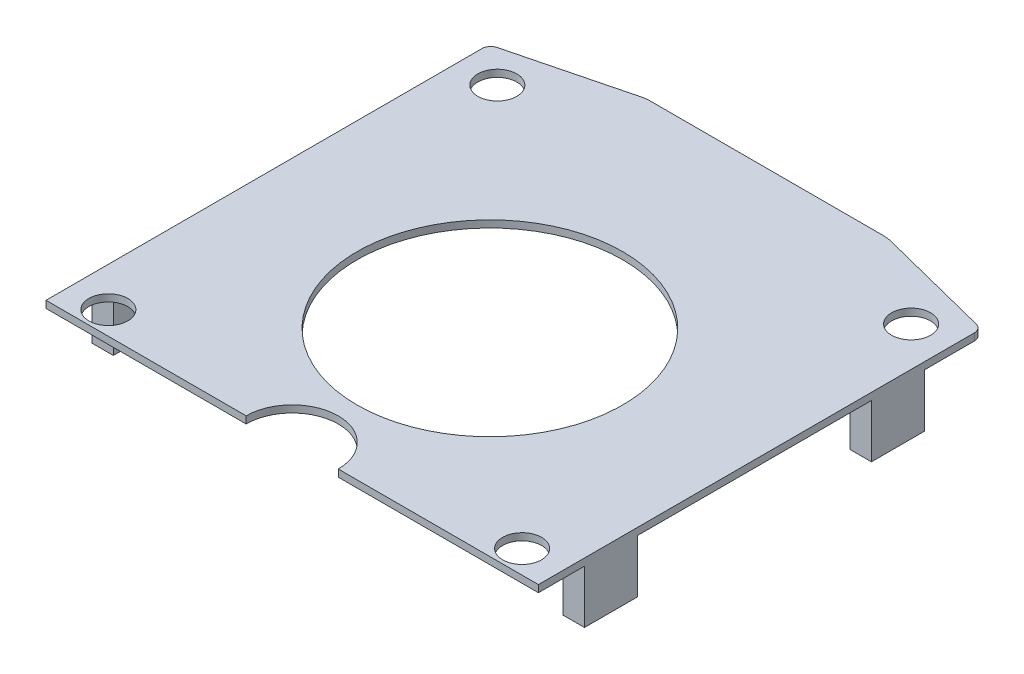
ISO-10303-21;
HEADER;
FILE_DESCRIPTION(('STEP AP214'),'2;1');
FILE_NAME('part.step','',(''),(''),'','','');
FILE_SCHEMA(('AUTOMOTIVE_DESIGN { 1 0 10303 214 1 1 1 1 }'));
ENDSEC;
DATA;
#1=APPLICATION_CONTEXT('core data for automotive mechanical design processes');
#2=APPLICATION_PROTOCOL_DEFINITION('international standard','automotive_design',2000,#1);
#3=PRODUCT_CONTEXT('',#1,'mechanical');
#4=PRODUCT('Part','Part','',(#3));
#5=PRODUCT_RELATED_PRODUCT_CATEGORY('part','',(#4));
#6=PRODUCT_DEFINITION_FORMATION('','',#4);
#7=PRODUCT_DEFINITION_CONTEXT('part definition',#1,'design');
#8=PRODUCT_DEFINITION('design','',#6,#7);
#9=PRODUCT_DEFINITION_SHAPE('','',#8);
#10=(LENGTH_UNIT() NAMED_UNIT(*) SI_UNIT(.MILLI.,.METRE.));
#11=(NAMED_UNIT(*) PLANE_ANGLE_UNIT() SI_UNIT($,.RADIAN.));
#12=(NAMED_UNIT(*) SI_UNIT($,.STERADIAN.) SOLID_ANGLE_UNIT());
#13=UNCERTAINTY_MEASURE_WITH_UNIT(LENGTH_MEASURE(1.E-05),#10,'distance_accuracy_value','');
#14=(GEOMETRIC_REPRESENTATION_CONTEXT(3) GLOBAL_UNCERTAINTY_ASSIGNED_CONTEXT((#13)) GLOBAL_UNIT_ASSIGNED_CONTEXT((#10,
#11,#12)) REPRESENTATION_CONTEXT('',''));
#15=CARTESIAN_POINT('',(0.,0.,0.));
#16=DIRECTION('',(0.,0.,1.));
#17=DIRECTION('',(1.,0.,0.));
#18=AXIS2_PLACEMENT_3D('',#15,#16,#17);
#19=CARTESIAN_POINT('',(0.,0.,0.));
#20=DIRECTION('',(0.,1.,0.));
#21=DIRECTION('',(0.,0.,1.));
#22=AXIS2_PLACEMENT_3D('',#19,#20,#21);
#23=PLANE('',#22);
#24=CARTESIAN_POINT('',(-1.11,0.,-23.53));
#25=DIRECTION('',(0.,1.,0.));
#26=DIRECTION('',(0.,0.,1.));
#27=AXIS2_PLACEMENT_3D('',#24,#25,#26);
#28=CIRCLE('',#27,0.549999999999999);
#29=CARTESIAN_POINT('',(-1.11,0.,-22.98));
#30=VERTEX_POINT('',#29);
#31=EDGE_CURVE('E359',#30,#30,#28,.T.);
#32=ORIENTED_EDGE('',*,*,#31,.T.);
#33=EDGE_LOOP('',(#32));
#34=FACE_BOUND('',#33,.T.);
#35=CARTESIAN_POINT('',(-6.95,0.,-17.48));
#36=DIRECTION('',(0.,1.,0.));
#37=DIRECTION('',(0.,0.,1.));
#38=AXIS2_PLACEMENT_3D('',#35,#36,#37);
#39=CIRCLE('',#38,3.75);
#40=CARTESIAN_POINT('',(-6.95,0.,-13.73));
#41=VERTEX_POINT('',#40);
#42=EDGE_CURVE('E446',#41,#41,#39,.T.);
#43=ORIENTED_EDGE('',*,*,#42,.T.);
#44=EDGE_LOOP('',(#43));
#45=FACE_BOUND('',#44,.T.);
#46=CARTESIAN_POINT('',(-12.79,0.,-12.55));
#47=DIRECTION('',(0.,1.,0.));
#48=DIRECTION('',(0.,0.,1.));
#49=AXIS2_PLACEMENT_3D('',#46,#47,#48);
#50=CIRCLE('',#49,0.55);
#51=CARTESIAN_POINT('',(-12.79,0.,-12.));
#52=VERTEX_POINT('',#51);
#53=EDGE_CURVE('E449',#52,#52,#50,.T.);
#54=ORIENTED_EDGE('',*,*,#53,.T.);
#55=EDGE_LOOP('',(#54));
#56=FACE_BOUND('',#55,.T.);
#57=CARTESIAN_POINT('',(-12.79,0.,-23.53));
#58=DIRECTION('',(0.,1.,0.));
#59=DIRECTION('',(0.,0.,1.));
#60=AXIS2_PLACEMENT_3D('',#57,#58,#59);
#61=CIRCLE('',#60,0.549999999999999);
#62=CARTESIAN_POINT('',(-12.79,0.,-22.98));
#63=VERTEX_POINT('',#62);
#64=EDGE_CURVE('E452',#63,#63,#61,.T.);
#65=ORIENTED_EDGE('',*,*,#64,.T.);
#66=EDGE_LOOP('',(#65));
#67=FACE_BOUND('',#66,.T.);
#68=CARTESIAN_POINT('',(-1.11,0.,-12.55));
#69=DIRECTION('',(0.,1.,0.));
#70=DIRECTION('',(0.,0.,1.));
#71=AXIS2_PLACEMENT_3D('',#68,#69,#70);
#72=CIRCLE('',#71,0.55);
#73=CARTESIAN_POINT('',(-1.11,0.,-12.));
#74=VERTEX_POINT('',#73);
#75=EDGE_CURVE('E393',#74,#74,#72,.T.);
#76=ORIENTED_EDGE('',*,*,#75,.T.);
#77=EDGE_LOOP('',(#76));
#78=FACE_BOUND('',#77,.T.);
#79=DIRECTION('',(-1.,0.,0.));
#80=VECTOR('',#79,1.);
#81=CARTESIAN_POINT('',(-13.9,0.,-21.3));
#82=LINE('',#81,#80);
#83=CARTESIAN_POINT('',(-13.3,0.,-21.3));
#84=VERTEX_POINT('',#83);
#85=CARTESIAN_POINT('',(-13.9,0.,-21.3));
#86=VERTEX_POINT('',#85);
#87=EDGE_CURVE('E51',#84,#86,#82,.T.);
#88=ORIENTED_EDGE('',*,*,#87,.F.);
#89=DIRECTION('',(0.,0.,1.));
#90=VECTOR('',#89,1.);
#91=CARTESIAN_POINT('',(-13.3,0.,-21.3));
#92=LINE('',#91,#90);
#93=CARTESIAN_POINT('',(-13.3,0.,-22.8));
#94=VERTEX_POINT('',#93);
#95=EDGE_CURVE('E56',#94,#84,#92,.T.);
#96=ORIENTED_EDGE('',*,*,#95,.F.);
#97=DIRECTION('',(1.,0.,0.));
#98=VECTOR('',#97,1.);
#99=CARTESIAN_POINT('',(-13.3,0.,-22.8));
#100=LINE('',#99,#98);
#101=CARTESIAN_POINT('',(-13.9,0.,-22.8));
#102=VERTEX_POINT('',#101);
#103=EDGE_CURVE('E239',#102,#94,#100,.T.);
#104=ORIENTED_EDGE('',*,*,#103,.F.);
#105=DIRECTION('',(0.,0.,-1.));
#106=VECTOR('',#105,1.);
#107=CARTESIAN_POINT('',(-13.9,0.,0.));
#108=LINE('',#107,#106);
#109=CARTESIAN_POINT('',(-13.9,0.,-24.2056062499114));
#110=VERTEX_POINT('',#109);
#111=EDGE_CURVE('E410',#102,#110,#108,.T.);
#112=ORIENTED_EDGE('',*,*,#111,.T.);
#113=CARTESIAN_POINT('',(-13.65,0.,-24.2056062499114));
#114=DIRECTION('',(0.,1.,0.));
#115=DIRECTION('',(0.,0.,1.));
#116=AXIS2_PLACEMENT_3D('',#113,#114,#115);
#117=CIRCLE('',#116,0.250000000000001);
#118=CARTESIAN_POINT('',(-13.7115996947729,0.,-24.4478983826848));
#119=VERTEX_POINT('',#118);
#120=EDGE_CURVE('E407',#119,#110,#117,.T.);
#121=ORIENTED_EDGE('',*,*,#120,.F.);
#122=DIRECTION('',(0.969168531093623,0.,-0.246398779091597));
#123=VECTOR('',#122,1.);
#124=CARTESIAN_POINT('',(-6.67066918510517,0.,-26.2379654614139));
#125=LINE('',#124,#123);
#126=CARTESIAN_POINT('',(-10.481270444365,0.,-25.2691685310936));
#127=VERTEX_POINT('',#126);
#128=EDGE_CURVE('E404',#119,#127,#125,.T.);
#129=ORIENTED_EDGE('',*,*,#128,.T.);
#130=CARTESIAN_POINT('',(-10.2348716652734,0.,-24.3));
#131=DIRECTION('',(0.,1.,0.));
#132=DIRECTION('',(0.,0.,1.));
#133=AXIS2_PLACEMENT_3D('',#130,#131,#132);
#134=CIRCLE('',#133,1.);
#135=CARTESIAN_POINT('',(-10.2348716652734,0.,-25.3));
#136=VERTEX_POINT('',#135);
#137=EDGE_CURVE('E401',#136,#127,#134,.T.);
#138=ORIENTED_EDGE('',*,*,#137,.F.);
#139=DIRECTION('',(-1.,0.,0.));
#140=VECTOR('',#139,1.);
#141=CARTESIAN_POINT('',(0.,0.,-25.3));
#142=LINE('',#141,#140);
#143=CARTESIAN_POINT('',(-3.66512833472655,0.,-25.3));
#144=VERTEX_POINT('',#143);
#145=EDGE_CURVE('E399',#144,#136,#142,.T.);
#146=ORIENTED_EDGE('',*,*,#145,.F.);
#147=CARTESIAN_POINT('',(-3.66512833472655,0.,-24.3));
#148=DIRECTION('',(0.,1.,0.));
#149=DIRECTION('',(0.,0.,1.));
#150=AXIS2_PLACEMENT_3D('',#147,#148,#149);
#151=CIRCLE('',#150,1.);
#152=CARTESIAN_POINT('',(-3.41872955563496,0.,-25.2691685310936));
#153=VERTEX_POINT('',#152);
#154=EDGE_CURVE('E396',#144,#153,#151,.F.);
#155=ORIENTED_EDGE('',*,*,#154,.T.);
#156=DIRECTION('',(0.969168531093623,0.,0.246398779091597));
#157=VECTOR('',#156,1.);
#158=CARTESIAN_POINT('',(5.82676740420935,0.,-22.9186184565569));
#159=LINE('',#158,#157);
#160=CARTESIAN_POINT('',(-0.1884003052271,0.,-24.4478983826848));
#161=VERTEX_POINT('',#160);
#162=EDGE_CURVE('E392',#153,#161,#159,.T.);
#163=ORIENTED_EDGE('',*,*,#162,.T.);
#164=CARTESIAN_POINT('',(-0.249999999999999,0.,-24.2056062499114));
#165=DIRECTION('',(0.,1.,0.));
#166=DIRECTION('',(0.,0.,1.));
#167=AXIS2_PLACEMENT_3D('',#164,#165,#166);
#168=CIRCLE('',#167,0.25);
#169=CARTESIAN_POINT('',(0.,0.,-24.2056062499114));
#170=VERTEX_POINT('',#169);
#171=EDGE_CURVE('E389',#161,#170,#168,.F.);
#172=ORIENTED_EDGE('',*,*,#171,.T.);
#173=DIRECTION('',(0.,0.,-1.));
#174=VECTOR('',#173,1.);
#175=CARTESIAN_POINT('',(0.,0.,0.));
#176=LINE('',#175,#174);
#177=CARTESIAN_POINT('',(0.,0.,-22.8));
#178=VERTEX_POINT('',#177);
#179=EDGE_CURVE('E418',#178,#170,#176,.T.);
#180=ORIENTED_EDGE('',*,*,#179,.F.);
#181=DIRECTION('',(1.,0.,0.));
#182=VECTOR('',#181,1.);
#183=CARTESIAN_POINT('',(-0.6,0.,-22.8));
#184=LINE('',#183,#182);
#185=CARTESIAN_POINT('',(-0.6,0.,-22.8));
#186=VERTEX_POINT('',#185);
#187=EDGE_CURVE('E329',#186,#178,#184,.T.);
#188=ORIENTED_EDGE('',*,*,#187,.F.);
#189=DIRECTION('',(0.,0.,1.));
#190=VECTOR('',#189,1.);
#191=CARTESIAN_POINT('',(-0.6,0.,-21.3));
#192=LINE('',#191,#190);
#193=CARTESIAN_POINT('',(-0.6,0.,-21.3));
#194=VERTEX_POINT('',#193);
#195=EDGE_CURVE('E308',#186,#194,#192,.T.);
#196=ORIENTED_EDGE('',*,*,#195,.T.);
#197=DIRECTION('',(1.,0.,0.));
#198=VECTOR('',#197,1.);
#199=CARTESIAN_POINT('',(-0.6,0.,-21.3));
#200=LINE('',#199,#198);
#201=CARTESIAN_POINT('',(0.,0.,-21.3));
#202=VERTEX_POINT('',#201);
#203=EDGE_CURVE('E321',#194,#202,#200,.T.);
#204=ORIENTED_EDGE('',*,*,#203,.T.);
#205=CARTESIAN_POINT('',(0.,0.,-14.7));
#206=VERTEX_POINT('',#205);
#207=EDGE_CURVE('E421',#206,#202,#176,.T.);
#208=ORIENTED_EDGE('',*,*,#207,.F.);
#209=DIRECTION('',(1.,0.,0.));
#210=VECTOR('',#209,1.);
#211=CARTESIAN_POINT('',(-0.6,0.,-14.7));
#212=LINE('',#211,#210);
#213=CARTESIAN_POINT('',(-0.6,0.,-14.7));
#214=VERTEX_POINT('',#213);
#215=EDGE_CURVE('E298',#214,#206,#212,.T.);
#216=ORIENTED_EDGE('',*,*,#215,.F.);
#217=DIRECTION('',(0.,0.,1.));
#218=VECTOR('',#217,1.);
#219=CARTESIAN_POINT('',(-0.6,0.,-14.7));
#220=LINE('',#219,#218);
#221=CARTESIAN_POINT('',(-0.6,0.,-13.2));
#222=VERTEX_POINT('',#221);
#223=EDGE_CURVE('E278',#214,#222,#220,.T.);
#224=ORIENTED_EDGE('',*,*,#223,.T.);
#225=DIRECTION('',(1.,0.,0.));
#226=VECTOR('',#225,1.);
#227=CARTESIAN_POINT('',(-0.6,0.,-13.2));
#228=LINE('',#227,#226);
#229=CARTESIAN_POINT('',(0.,0.,-13.2));
#230=VERTEX_POINT('',#229);
#231=EDGE_CURVE('E291',#222,#230,#228,.T.);
#232=ORIENTED_EDGE('',*,*,#231,.T.);
#233=CARTESIAN_POINT('',(0.,0.,-11.9));
#234=VERTEX_POINT('',#233);
#235=EDGE_CURVE('E364',#234,#230,#176,.T.);
#236=ORIENTED_EDGE('',*,*,#235,.F.);
#237=DIRECTION('',(-1.,0.,0.));
#238=VECTOR('',#237,1.);
#239=CARTESIAN_POINT('',(0.,0.,-11.9));
#240=LINE('',#239,#238);
#241=CARTESIAN_POINT('',(-5.65,0.,-11.9));
#242=VERTEX_POINT('',#241);
#243=EDGE_CURVE('E415',#234,#242,#240,.T.);
#244=ORIENTED_EDGE('',*,*,#243,.T.);
#245=CARTESIAN_POINT('',(-6.95,0.,-11.9));
#246=DIRECTION('',(0.,1.,0.));
#247=DIRECTION('',(0.,0.,1.));
#248=AXIS2_PLACEMENT_3D('',#245,#246,#247);
#249=CIRCLE('',#248,1.3);
#250=CARTESIAN_POINT('',(-8.25,0.,-11.9));
#251=VERTEX_POINT('',#250);
#252=EDGE_CURVE('E11',#242,#251,#249,.T.);
#253=ORIENTED_EDGE('',*,*,#252,.T.);
#254=CARTESIAN_POINT('',(-13.9,0.,-11.9));
#255=VERTEX_POINT('',#254);
#256=EDGE_CURVE('E413',#251,#255,#240,.T.);
#257=ORIENTED_EDGE('',*,*,#256,.T.);
#258=CARTESIAN_POINT('',(-13.9,0.,-13.2));
#259=VERTEX_POINT('',#258);
#260=EDGE_CURVE('E411',#255,#259,#108,.T.);
#261=ORIENTED_EDGE('',*,*,#260,.T.);
#262=DIRECTION('',(-1.,0.,0.));
#263=VECTOR('',#262,1.);
#264=CARTESIAN_POINT('',(-13.3,0.,-13.2));
#265=LINE('',#264,#263);
#266=CARTESIAN_POINT('',(-13.3,0.,-13.2));
#267=VERTEX_POINT('',#266);
#268=EDGE_CURVE('E245',#267,#259,#265,.T.);
#269=ORIENTED_EDGE('',*,*,#268,.F.);
#270=DIRECTION('',(0.,0.,1.));
#271=VECTOR('',#270,1.);
#272=CARTESIAN_POINT('',(-13.3,0.,-14.7));
#273=LINE('',#272,#271);
#274=CARTESIAN_POINT('',(-13.3,0.,-14.7));
#275=VERTEX_POINT('',#274);
#276=EDGE_CURVE('E242',#275,#267,#273,.T.);
#277=ORIENTED_EDGE('',*,*,#276,.F.);
#278=DIRECTION('',(1.,0.,0.));
#279=VECTOR('',#278,1.);
#280=CARTESIAN_POINT('',(-13.9,0.,-14.7));
#281=LINE('',#280,#279);
#282=CARTESIAN_POINT('',(-13.9,0.,-14.7));
#283=VERTEX_POINT('',#282);
#284=EDGE_CURVE('E255',#283,#275,#281,.T.);
#285=ORIENTED_EDGE('',*,*,#284,.F.);
#286=EDGE_CURVE('E414',#283,#86,#108,.T.);
#287=ORIENTED_EDGE('',*,*,#286,.T.);
#288=EDGE_LOOP('',(#88,#96,#104,#112,#121,#129,#138,#146,#155,#163,#172,#180,#188,#196,#204,
#208,#216,#224,#232,#236,#244,#253,#257,#261,#269,#277,#285,#287));
#289=FACE_BOUND('',#288,.T.);
#290=ADVANCED_FACE('F36',(#34,#45,#56,#67,#78,#289),#23,.F.);
#291=CARTESIAN_POINT('',(0.,0.2,-11.9));
#292=DIRECTION('',(0.,0.,1.));
#293=DIRECTION('',(1.,0.,0.));
#294=AXIS2_PLACEMENT_3D('',#291,#292,#293);
#295=PLANE('',#294);
#296=DIRECTION('',(0.,1.,0.));
#297=VECTOR('',#296,1.);
#298=CARTESIAN_POINT('',(-5.65,-0.1,-11.9));
#299=LINE('',#298,#297);
#300=CARTESIAN_POINT('',(-5.65,0.2,-11.9));
#301=VERTEX_POINT('',#300);
#302=EDGE_CURVE('E340',#242,#301,#299,.T.);
#303=ORIENTED_EDGE('',*,*,#302,.F.);
#304=ORIENTED_EDGE('',*,*,#243,.F.);
#305=DIRECTION('',(0.,-1.,0.));
#306=VECTOR('',#305,1.);
#307=CARTESIAN_POINT('',(0.,0.2,-11.9));
#308=LINE('',#307,#306);
#309=CARTESIAN_POINT('',(0.,0.2,-11.9));
#310=VERTEX_POINT('',#309);
#311=EDGE_CURVE('E424',#310,#234,#308,.T.);
#312=ORIENTED_EDGE('',*,*,#311,.F.);
#313=DIRECTION('',(-1.,0.,0.));
#314=VECTOR('',#313,1.);
#315=CARTESIAN_POINT('',(0.,0.2,-11.9));
#316=LINE('',#315,#314);
#317=EDGE_CURVE('E383',#310,#301,#316,.T.);
#318=ORIENTED_EDGE('',*,*,#317,.T.);
#319=EDGE_LOOP('',(#303,#304,#312,#318));
#320=FACE_BOUND('',#319,.T.);
#321=ADVANCED_FACE('F476',(#320),#295,.T.);
#322=CARTESIAN_POINT('',(-0.249999999999999,0.2,-24.2056062499114));
#323=DIRECTION('',(0.,-1.,0.));
#324=DIRECTION('',(0.,0.,-1.));
#325=AXIS2_PLACEMENT_3D('',#322,#323,#324);
#326=CYLINDRICAL_SURFACE('',#325,0.25);
#327=ORIENTED_EDGE('',*,*,#171,.F.);
#328=DIRECTION('',(0.,-1.,0.));
#329=VECTOR('',#328,1.);
#330=CARTESIAN_POINT('',(-0.1884003052271,0.2,-24.4478983826848));
#331=LINE('',#330,#329);
#332=CARTESIAN_POINT('',(-0.1884003052271,0.2,-24.4478983826848));
#333=VERTEX_POINT('',#332);
#334=EDGE_CURVE('E44',#333,#161,#331,.T.);
#335=ORIENTED_EDGE('',*,*,#334,.F.);
#336=CARTESIAN_POINT('',(-0.249999999999999,0.2,-24.2056062499114));
#337=DIRECTION('',(0.,1.,0.));
#338=DIRECTION('',(0.,0.,1.));
#339=AXIS2_PLACEMENT_3D('',#336,#337,#338);
#340=CIRCLE('',#339,0.25);
#341=CARTESIAN_POINT('',(0.,0.2,-24.2056062499114));
#342=VERTEX_POINT('',#341);
#343=EDGE_CURVE('E360',#333,#342,#340,.F.);
#344=ORIENTED_EDGE('',*,*,#343,.T.);
#345=DIRECTION('',(0.,-1.,0.));
#346=VECTOR('',#345,1.);
#347=CARTESIAN_POINT('',(0.,0.2,-24.2056062499114));
#348=LINE('',#347,#346);
#349=EDGE_CURVE('E388',#342,#170,#348,.T.);
#350=ORIENTED_EDGE('',*,*,#349,.T.);
#351=EDGE_LOOP('',(#327,#335,#344,#350));
#352=FACE_BOUND('',#351,.T.);
#353=ADVANCED_FACE('F38',(#352),#326,.T.);
#354=CARTESIAN_POINT('',(5.82676740420935,0.2,-22.9186184565569));
#355=DIRECTION('',(0.246398779091597,0.,-0.969168531093623));
#356=DIRECTION('',(-0.969168531093623,0.,-0.246398779091597));
#357=AXIS2_PLACEMENT_3D('',#354,#355,#356);
#358=PLANE('',#357);
#359=ORIENTED_EDGE('',*,*,#162,.F.);
#360=DIRECTION('',(0.,-1.,0.));
#361=VECTOR('',#360,1.);
#362=CARTESIAN_POINT('',(-3.41872955563496,0.2,-25.2691685310936));
#363=LINE('',#362,#361);
#364=CARTESIAN_POINT('',(-3.41872955563496,0.2,-25.2691685310936));
#365=VERTEX_POINT('',#364);
#366=EDGE_CURVE('E441',#365,#153,#363,.T.);
#367=ORIENTED_EDGE('',*,*,#366,.F.);
#368=DIRECTION('',(0.969168531093623,0.,0.246398779091597));
#369=VECTOR('',#368,1.);
#370=CARTESIAN_POINT('',(5.82676740420935,0.2,-22.9186184565569));
#371=LINE('',#370,#369);
#372=EDGE_CURVE('E363',#365,#333,#371,.T.);
#373=ORIENTED_EDGE('',*,*,#372,.T.);
#374=ORIENTED_EDGE('',*,*,#334,.T.);
#375=EDGE_LOOP('',(#359,#367,#373,#374));
#376=FACE_BOUND('',#375,.T.);
#377=ADVANCED_FACE('F518',(#376),#358,.T.);
#378=CARTESIAN_POINT('',(-3.66512833472655,0.2,-24.3));
#379=DIRECTION('',(0.,-1.,0.));
#380=DIRECTION('',(0.,0.,-1.));
#381=AXIS2_PLACEMENT_3D('',#378,#379,#380);
#382=CYLINDRICAL_SURFACE('',#381,1.);
#383=ORIENTED_EDGE('',*,*,#154,.F.);
#384=DIRECTION('',(0.,-1.,0.));
#385=VECTOR('',#384,1.);
#386=CARTESIAN_POINT('',(-3.66512833472655,0.2,-25.3));
#387=LINE('',#386,#385);
#388=CARTESIAN_POINT('',(-3.66512833472655,0.2,-25.3));
#389=VERTEX_POINT('',#388);
#390=EDGE_CURVE('E439',#389,#144,#387,.T.);
#391=ORIENTED_EDGE('',*,*,#390,.F.);
#392=CARTESIAN_POINT('',(-3.66512833472655,0.2,-24.3));
#393=DIRECTION('',(0.,1.,0.));
#394=DIRECTION('',(0.,0.,1.));
#395=AXIS2_PLACEMENT_3D('',#392,#393,#394);
#396=CIRCLE('',#395,1.);
#397=EDGE_CURVE('E367',#389,#365,#396,.F.);
#398=ORIENTED_EDGE('',*,*,#397,.T.);
#399=ORIENTED_EDGE('',*,*,#366,.T.);
#400=EDGE_LOOP('',(#383,#391,#398,#399));
#401=FACE_BOUND('',#400,.T.);
#402=ADVANCED_FACE('F515',(#401),#382,.T.);
#403=CARTESIAN_POINT('',(0.,0.2,-25.3));
#404=DIRECTION('',(0.,0.,1.));
#405=DIRECTION('',(1.,0.,0.));
#406=AXIS2_PLACEMENT_3D('',#403,#404,#405);
#407=PLANE('',#406);
#408=ORIENTED_EDGE('',*,*,#145,.T.);
#409=DIRECTION('',(0.,-1.,0.));
#410=VECTOR('',#409,1.);
#411=CARTESIAN_POINT('',(-10.2348716652734,0.2,-25.3));
#412=LINE('',#411,#410);
#413=CARTESIAN_POINT('',(-10.2348716652734,0.2,-25.3));
#414=VERTEX_POINT('',#413);
#415=EDGE_CURVE('E436',#414,#136,#412,.T.);
#416=ORIENTED_EDGE('',*,*,#415,.F.);
#417=DIRECTION('',(-1.,0.,0.));
#418=VECTOR('',#417,1.);
#419=CARTESIAN_POINT('',(0.,0.2,-25.3));
#420=LINE('',#419,#418);
#421=EDGE_CURVE('E370',#389,#414,#420,.T.);
#422=ORIENTED_EDGE('',*,*,#421,.F.);
#423=ORIENTED_EDGE('',*,*,#390,.T.);
#424=EDGE_LOOP('',(#408,#416,#422,#423));
#425=FACE_BOUND('',#424,.T.);
#426=ADVANCED_FACE('F511',(#425),#407,.F.);
#427=CARTESIAN_POINT('',(-10.2348716652734,0.2,-24.3));
#428=DIRECTION('',(0.,-1.,0.));
#429=DIRECTION('',(0.,0.,-1.));
#430=AXIS2_PLACEMENT_3D('',#427,#428,#429);
#431=CYLINDRICAL_SURFACE('',#430,1.);
#432=ORIENTED_EDGE('',*,*,#137,.T.);
#433=DIRECTION('',(0.,-1.,0.));
#434=VECTOR('',#433,1.);
#435=CARTESIAN_POINT('',(-10.481270444365,0.2,-25.2691685310936));
#436=LINE('',#435,#434);
#437=CARTESIAN_POINT('',(-10.481270444365,0.2,-25.2691685310936));
#438=VERTEX_POINT('',#437);
#439=EDGE_CURVE('E434',#438,#127,#436,.T.);
#440=ORIENTED_EDGE('',*,*,#439,.F.);
#441=CARTESIAN_POINT('',(-10.2348716652734,0.2,-24.3));
#442=DIRECTION('',(0.,1.,0.));
#443=DIRECTION('',(0.,0.,1.));
#444=AXIS2_PLACEMENT_3D('',#441,#442,#443);
#445=CIRCLE('',#444,1.);
#446=EDGE_CURVE('E372',#414,#438,#445,.T.);
#447=ORIENTED_EDGE('',*,*,#446,.F.);
#448=ORIENTED_EDGE('',*,*,#415,.T.);
#449=EDGE_LOOP('',(#432,#440,#447,#448));
#450=FACE_BOUND('',#449,.T.);
#451=ADVANCED_FACE('F507',(#450),#431,.T.);
#452=CARTESIAN_POINT('',(-6.67066918510517,0.2,-26.2379654614139));
#453=DIRECTION('',(-0.246398779091597,0.,-0.969168531093623));
#454=DIRECTION('',(-0.969168531093623,0.,0.246398779091597));
#455=AXIS2_PLACEMENT_3D('',#452,#453,#454);
#456=PLANE('',#455);
#457=ORIENTED_EDGE('',*,*,#128,.F.);
#458=DIRECTION('',(0.,-1.,0.));
#459=VECTOR('',#458,1.);
#460=CARTESIAN_POINT('',(-13.7115996947729,0.2,-24.4478983826848));
#461=LINE('',#460,#459);
#462=CARTESIAN_POINT('',(-13.7115996947729,0.2,-24.4478983826848));
#463=VERTEX_POINT('',#462);
#464=EDGE_CURVE('E432',#463,#119,#461,.T.);
#465=ORIENTED_EDGE('',*,*,#464,.F.);
#466=DIRECTION('',(0.969168531093623,0.,-0.246398779091597));
#467=VECTOR('',#466,1.);
#468=CARTESIAN_POINT('',(-6.67066918510517,0.2,-26.2379654614139));
#469=LINE('',#468,#467);
#470=EDGE_CURVE('E374',#463,#438,#469,.T.);
#471=ORIENTED_EDGE('',*,*,#470,.T.);
#472=ORIENTED_EDGE('',*,*,#439,.T.);
#473=EDGE_LOOP('',(#457,#465,#471,#472));
#474=FACE_BOUND('',#473,.T.);
#475=ADVANCED_FACE('F503',(#474),#456,.T.);
#476=CARTESIAN_POINT('',(-13.65,0.2,-24.2056062499114));
#477=DIRECTION('',(0.,-1.,0.));
#478=DIRECTION('',(0.,0.,-1.));
#479=AXIS2_PLACEMENT_3D('',#476,#477,#478);
#480=CYLINDRICAL_SURFACE('',#479,0.250000000000001);
#481=ORIENTED_EDGE('',*,*,#120,.T.);
#482=DIRECTION('',(0.,-1.,0.));
#483=VECTOR('',#482,1.);
#484=CARTESIAN_POINT('',(-13.9,0.2,-24.2056062499114));
#485=LINE('',#484,#483);
#486=CARTESIAN_POINT('',(-13.9,0.2,-24.2056062499114));
#487=VERTEX_POINT('',#486);
#488=EDGE_CURVE('E429',#487,#110,#485,.T.);
#489=ORIENTED_EDGE('',*,*,#488,.F.);
#490=CARTESIAN_POINT('',(-13.65,0.2,-24.2056062499114));
#491=DIRECTION('',(0.,1.,0.));
#492=DIRECTION('',(0.,0.,1.));
#493=AXIS2_PLACEMENT_3D('',#490,#491,#492);
#494=CIRCLE('',#493,0.250000000000001);
#495=EDGE_CURVE('E377',#463,#487,#494,.T.);
#496=ORIENTED_EDGE('',*,*,#495,.F.);
#497=ORIENTED_EDGE('',*,*,#464,.T.);
#498=EDGE_LOOP('',(#481,#489,#496,#497));
#499=FACE_BOUND('',#498,.T.);
#500=ADVANCED_FACE('F499',(#499),#480,.T.);
#501=CARTESIAN_POINT('',(-13.9,0.2,0.));
#502=DIRECTION('',(-1.,0.,0.));
#503=DIRECTION('',(0.,0.,1.));
#504=AXIS2_PLACEMENT_3D('',#501,#502,#503);
#505=PLANE('',#504);
#506=ORIENTED_EDGE('',*,*,#260,.F.);
#507=DIRECTION('',(0.,-1.,0.));
#508=VECTOR('',#507,1.);
#509=CARTESIAN_POINT('',(-13.9,0.2,-11.9));
#510=LINE('',#509,#508);
#511=CARTESIAN_POINT('',(-13.9,0.2,-11.9));
#512=VERTEX_POINT('',#511);
#513=EDGE_CURVE('E426',#512,#255,#510,.T.);
#514=ORIENTED_EDGE('',*,*,#513,.F.);
#515=DIRECTION('',(0.,0.,-1.));
#516=VECTOR('',#515,1.);
#517=CARTESIAN_POINT('',(-13.9,0.2,0.));
#518=LINE('',#517,#516);
#519=EDGE_CURVE('E379',#512,#487,#518,.T.);
#520=ORIENTED_EDGE('',*,*,#519,.T.);
#521=ORIENTED_EDGE('',*,*,#488,.T.);
#522=ORIENTED_EDGE('',*,*,#111,.F.);
#523=DIRECTION('',(0.,1.,0.));
#524=VECTOR('',#523,1.);
#525=CARTESIAN_POINT('',(-13.9,-1.5,-22.8));
#526=LINE('',#525,#524);
#527=CARTESIAN_POINT('',(-13.9,-1.5,-22.8));
#528=VERTEX_POINT('',#527);
#529=EDGE_CURVE('E247',#528,#102,#526,.T.);
#530=ORIENTED_EDGE('',*,*,#529,.F.);
#531=DIRECTION('',(0.,0.,-1.));
#532=VECTOR('',#531,1.);
#533=CARTESIAN_POINT('',(-13.9,-1.5,-22.8));
#534=LINE('',#533,#532);
#535=CARTESIAN_POINT('',(-13.9,-1.5,-21.3));
#536=VERTEX_POINT('',#535);
#537=EDGE_CURVE('E229',#536,#528,#534,.T.);
#538=ORIENTED_EDGE('',*,*,#537,.F.);
#539=DIRECTION('',(0.,1.,0.));
#540=VECTOR('',#539,1.);
#541=CARTESIAN_POINT('',(-13.9,-1.5,-21.3));
#542=LINE('',#541,#540);
#543=EDGE_CURVE('E226',#536,#86,#542,.T.);
#544=ORIENTED_EDGE('',*,*,#543,.T.);
#545=ORIENTED_EDGE('',*,*,#286,.F.);
#546=DIRECTION('',(0.,1.,0.));
#547=VECTOR('',#546,1.);
#548=CARTESIAN_POINT('',(-13.9,-1.5,-14.7));
#549=LINE('',#548,#547);
#550=CARTESIAN_POINT('',(-13.9,-1.5,-14.7));
#551=VERTEX_POINT('',#550);
#552=EDGE_CURVE('E268',#551,#283,#549,.T.);
#553=ORIENTED_EDGE('',*,*,#552,.F.);
#554=DIRECTION('',(0.,0.,-1.));
#555=VECTOR('',#554,1.);
#556=CARTESIAN_POINT('',(-13.9,-1.5,-13.2));
#557=LINE('',#556,#555);
#558=CARTESIAN_POINT('',(-13.9,-1.5,-13.2));
#559=VERTEX_POINT('',#558);
#560=EDGE_CURVE('E257',#559,#551,#557,.T.);
#561=ORIENTED_EDGE('',*,*,#560,.F.);
#562=DIRECTION('',(0.,1.,0.));
#563=VECTOR('',#562,1.);
#564=CARTESIAN_POINT('',(-13.9,-1.5,-13.2));
#565=LINE('',#564,#563);
#566=EDGE_CURVE('E271',#559,#259,#565,.T.);
#567=ORIENTED_EDGE('',*,*,#566,.T.);
#568=EDGE_LOOP('',(#506,#514,#520,#521,#522,#530,#538,#544,#545,#553,#561,#567));
#569=FACE_BOUND('',#568,.T.);
#570=ADVANCED_FACE('F495',(#569),#505,.T.);
#571=DIRECTION('',(0.,1.,0.));
#572=VECTOR('',#571,1.);
#573=CARTESIAN_POINT('',(-8.25,-0.1,-11.9));
#574=LINE('',#573,#572);
#575=CARTESIAN_POINT('',(-8.25,0.2,-11.9));
#576=VERTEX_POINT('',#575);
#577=EDGE_CURVE('E339',#251,#576,#574,.T.);
#578=ORIENTED_EDGE('',*,*,#577,.T.);
#579=EDGE_CURVE('E382',#576,#512,#316,.T.);
#580=ORIENTED_EDGE('',*,*,#579,.T.);
#581=ORIENTED_EDGE('',*,*,#513,.T.);
#582=ORIENTED_EDGE('',*,*,#256,.F.);
#583=EDGE_LOOP('',(#578,#580,#581,#582));
#584=FACE_BOUND('',#583,.T.);
#585=ADVANCED_FACE('F484',(#584),#295,.T.);
#586=CARTESIAN_POINT('',(0.,0.2,0.));
#587=DIRECTION('',(-1.,0.,0.));
#588=DIRECTION('',(0.,0.,1.));
#589=AXIS2_PLACEMENT_3D('',#586,#587,#588);
#590=PLANE('',#589);
#591=ORIENTED_EDGE('',*,*,#235,.T.);
#592=DIRECTION('',(0.,-1.,0.));
#593=VECTOR('',#592,1.);
#594=CARTESIAN_POINT('',(0.,-1.5,-13.2));
#595=LINE('',#594,#593);
#596=CARTESIAN_POINT('',(0.,-1.5,-13.2));
#597=VERTEX_POINT('',#596);
#598=EDGE_CURVE('E277',#230,#597,#595,.T.);
#599=ORIENTED_EDGE('',*,*,#598,.T.);
#600=DIRECTION('',(0.,0.,-1.));
#601=VECTOR('',#600,1.);
#602=CARTESIAN_POINT('',(0.,-1.5,-14.7));
#603=LINE('',#602,#601);
#604=CARTESIAN_POINT('',(0.,-1.5,-14.7));
#605=VERTEX_POINT('',#604);
#606=EDGE_CURVE('E294',#597,#605,#603,.T.);
#607=ORIENTED_EDGE('',*,*,#606,.T.);
#608=DIRECTION('',(0.,1.,0.));
#609=VECTOR('',#608,1.);
#610=CARTESIAN_POINT('',(0.,0.,-14.7));
#611=LINE('',#610,#609);
#612=EDGE_CURVE('E282',#605,#206,#611,.T.);
#613=ORIENTED_EDGE('',*,*,#612,.T.);
#614=ORIENTED_EDGE('',*,*,#207,.T.);
#615=DIRECTION('',(0.,-1.,0.));
#616=VECTOR('',#615,1.);
#617=CARTESIAN_POINT('',(0.,-1.5,-21.3));
#618=LINE('',#617,#616);
#619=CARTESIAN_POINT('',(0.,-1.5,-21.3));
#620=VERTEX_POINT('',#619);
#621=EDGE_CURVE('E301',#202,#620,#618,.T.);
#622=ORIENTED_EDGE('',*,*,#621,.T.);
#623=DIRECTION('',(0.,0.,-1.));
#624=VECTOR('',#623,1.);
#625=CARTESIAN_POINT('',(0.,-1.5,-22.8));
#626=LINE('',#625,#624);
#627=CARTESIAN_POINT('',(0.,-1.5,-22.8));
#628=VERTEX_POINT('',#627);
#629=EDGE_CURVE('E324',#620,#628,#626,.T.);
#630=ORIENTED_EDGE('',*,*,#629,.T.);
#631=DIRECTION('',(0.,1.,0.));
#632=VECTOR('',#631,1.);
#633=CARTESIAN_POINT('',(0.,0.,-22.8));
#634=LINE('',#633,#632);
#635=EDGE_CURVE('E312',#628,#178,#634,.T.);
#636=ORIENTED_EDGE('',*,*,#635,.T.);
#637=ORIENTED_EDGE('',*,*,#179,.T.);
#638=ORIENTED_EDGE('',*,*,#349,.F.);
#639=DIRECTION('',(0.,0.,-1.));
#640=VECTOR('',#639,1.);
#641=CARTESIAN_POINT('',(0.,0.2,0.));
#642=LINE('',#641,#640);
#643=EDGE_CURVE('E386',#310,#342,#642,.T.);
#644=ORIENTED_EDGE('',*,*,#643,.F.);
#645=ORIENTED_EDGE('',*,*,#311,.T.);
#646=EDGE_LOOP('',(#591,#599,#607,#613,#614,#622,#630,#636,#637,#638,#644,#645));
#647=FACE_BOUND('',#646,.T.);
#648=ADVANCED_FACE('F490',(#647),#590,.F.);
#649=CARTESIAN_POINT('',(0.,0.2,0.));
#650=DIRECTION('',(0.,1.,0.));
#651=DIRECTION('',(0.,0.,1.));
#652=AXIS2_PLACEMENT_3D('',#649,#650,#651);
#653=PLANE('',#652);
#654=CARTESIAN_POINT('',(-6.95,0.2,-11.9));
#655=DIRECTION('',(0.,1.,0.));
#656=DIRECTION('',(0.,0.,1.));
#657=AXIS2_PLACEMENT_3D('',#654,#655,#656);
#658=CIRCLE('',#657,1.3);
#659=EDGE_CURVE('E331',#301,#576,#658,.T.);
#660=ORIENTED_EDGE('',*,*,#659,.F.);
#661=ORIENTED_EDGE('',*,*,#317,.F.);
#662=ORIENTED_EDGE('',*,*,#643,.T.);
#663=ORIENTED_EDGE('',*,*,#343,.F.);
#664=ORIENTED_EDGE('',*,*,#372,.F.);
#665=ORIENTED_EDGE('',*,*,#397,.F.);
#666=ORIENTED_EDGE('',*,*,#421,.T.);
#667=ORIENTED_EDGE('',*,*,#446,.T.);
#668=ORIENTED_EDGE('',*,*,#470,.F.);
#669=ORIENTED_EDGE('',*,*,#495,.T.);
#670=ORIENTED_EDGE('',*,*,#519,.F.);
#671=ORIENTED_EDGE('',*,*,#579,.F.);
#672=EDGE_LOOP('',(#660,#661,#662,#663,#664,#665,#666,#667,#668,#669,#670,#671));
#673=FACE_BOUND('',#672,.T.);
#674=CARTESIAN_POINT('',(-1.11,0.2,-12.55));
#675=DIRECTION('',(0.,1.,0.));
#676=DIRECTION('',(0.,0.,1.));
#677=AXIS2_PLACEMENT_3D('',#674,#675,#676);
#678=CIRCLE('',#677,0.55);
#679=CARTESIAN_POINT('',(-1.11,0.2,-12.));
#680=VERTEX_POINT('',#679);
#681=EDGE_CURVE('E351',#680,#680,#678,.T.);
#682=ORIENTED_EDGE('',*,*,#681,.F.);
#683=EDGE_LOOP('',(#682));
#684=FACE_BOUND('',#683,.T.);
#685=CARTESIAN_POINT('',(-12.79,0.2,-23.53));
#686=DIRECTION('',(0.,1.,0.));
#687=DIRECTION('',(0.,0.,-1.));
#688=AXIS2_PLACEMENT_3D('',#685,#686,#687);
#689=CIRCLE('',#688,0.549999999999999);
#690=CARTESIAN_POINT('',(-12.79,0.2,-24.08));
#691=VERTEX_POINT('',#690);
#692=EDGE_CURVE('E348',#691,#691,#689,.T.);
#693=ORIENTED_EDGE('',*,*,#692,.F.);
#694=EDGE_LOOP('',(#693));
#695=FACE_BOUND('',#694,.T.);
#696=CARTESIAN_POINT('',(-12.79,0.2,-12.55));
#697=DIRECTION('',(0.,1.,0.));
#698=DIRECTION('',(0.,0.,-1.));
#699=AXIS2_PLACEMENT_3D('',#696,#697,#698);
#700=CIRCLE('',#699,0.55);
#701=CARTESIAN_POINT('',(-12.79,0.2,-13.1));
#702=VERTEX_POINT('',#701);
#703=EDGE_CURVE('E345',#702,#702,#700,.T.);
#704=ORIENTED_EDGE('',*,*,#703,.F.);
#705=EDGE_LOOP('',(#704));
#706=FACE_BOUND('',#705,.T.);
#707=CARTESIAN_POINT('',(-6.95,0.2,-17.48));
#708=DIRECTION('',(0.,1.,0.));
#709=DIRECTION('',(0.,0.,1.));
#710=AXIS2_PLACEMENT_3D('',#707,#708,#709);
#711=CIRCLE('',#710,3.75);
#712=CARTESIAN_POINT('',(-6.95,0.2,-13.73));
#713=VERTEX_POINT('',#712);
#714=EDGE_CURVE('E342',#713,#713,#711,.T.);
#715=ORIENTED_EDGE('',*,*,#714,.F.);
#716=EDGE_LOOP('',(#715));
#717=FACE_BOUND('',#716,.T.);
#718=CARTESIAN_POINT('',(-1.11,0.2,-23.53));
#719=DIRECTION('',(0.,1.,0.));
#720=DIRECTION('',(0.,0.,1.));
#721=AXIS2_PLACEMENT_3D('',#718,#719,#720);
#722=CIRCLE('',#721,0.549999999999999);
#723=CARTESIAN_POINT('',(-1.11,0.2,-22.98));
#724=VERTEX_POINT('',#723);
#725=EDGE_CURVE('E354',#724,#724,#722,.T.);
#726=ORIENTED_EDGE('',*,*,#725,.F.);
#727=EDGE_LOOP('',(#726));
#728=FACE_BOUND('',#727,.T.);
#729=ADVANCED_FACE('F488',(#673,#684,#695,#706,#717,#728),#653,.T.);
#730=CARTESIAN_POINT('',(-1.11,-0.1,-23.53));
#731=DIRECTION('',(0.,1.,0.));
#732=DIRECTION('',(0.,0.,1.));
#733=AXIS2_PLACEMENT_3D('',#730,#731,#732);
#734=CYLINDRICAL_SURFACE('',#733,0.549999999999999);
#735=ORIENTED_EDGE('',*,*,#725,.T.);
#736=EDGE_LOOP('',(#735));
#737=FACE_BOUND('',#736,.T.);
#738=ORIENTED_EDGE('',*,*,#31,.F.);
#739=EDGE_LOOP('',(#738));
#740=FACE_BOUND('',#739,.T.);
#741=ADVANCED_FACE('F574',(#737,#740),#734,.F.);
#742=CARTESIAN_POINT('',(-6.95,-0.1,-17.48));
#743=DIRECTION('',(0.,1.,0.));
#744=DIRECTION('',(0.,0.,1.));
#745=AXIS2_PLACEMENT_3D('',#742,#743,#744);
#746=CYLINDRICAL_SURFACE('',#745,3.75);
#747=ORIENTED_EDGE('',*,*,#714,.T.);
#748=EDGE_LOOP('',(#747));
#749=FACE_BOUND('',#748,.T.);
#750=ORIENTED_EDGE('',*,*,#42,.F.);
#751=EDGE_LOOP('',(#750));
#752=FACE_BOUND('',#751,.T.);
#753=ADVANCED_FACE('F571',(#749,#752),#746,.F.);
#754=CARTESIAN_POINT('',(-12.79,-0.1,-12.55));
#755=DIRECTION('',(0.,1.,0.));
#756=DIRECTION('',(0.,0.,1.));
#757=AXIS2_PLACEMENT_3D('',#754,#755,#756);
#758=CYLINDRICAL_SURFACE('',#757,0.55);
#759=ORIENTED_EDGE('',*,*,#703,.T.);
#760=EDGE_LOOP('',(#759));
#761=FACE_BOUND('',#760,.T.);
#762=ORIENTED_EDGE('',*,*,#53,.F.);
#763=EDGE_LOOP('',(#762));
#764=FACE_BOUND('',#763,.T.);
#765=ADVANCED_FACE('F471',(#761,#764),#758,.F.);
#766=CARTESIAN_POINT('',(-12.79,-0.1,-23.53));
#767=DIRECTION('',(0.,1.,0.));
#768=DIRECTION('',(0.,0.,1.));
#769=AXIS2_PLACEMENT_3D('',#766,#767,#768);
#770=CYLINDRICAL_SURFACE('',#769,0.549999999999999);
#771=ORIENTED_EDGE('',*,*,#692,.T.);
#772=EDGE_LOOP('',(#771));
#773=FACE_BOUND('',#772,.T.);
#774=ORIENTED_EDGE('',*,*,#64,.F.);
#775=EDGE_LOOP('',(#774));
#776=FACE_BOUND('',#775,.T.);
#777=ADVANCED_FACE('F461',(#773,#776),#770,.F.);
#778=CARTESIAN_POINT('',(-1.11,-0.1,-12.55));
#779=DIRECTION('',(0.,1.,0.));
#780=DIRECTION('',(0.,0.,1.));
#781=AXIS2_PLACEMENT_3D('',#778,#779,#780);
#782=CYLINDRICAL_SURFACE('',#781,0.55);
#783=ORIENTED_EDGE('',*,*,#681,.T.);
#784=EDGE_LOOP('',(#783));
#785=FACE_BOUND('',#784,.T.);
#786=ORIENTED_EDGE('',*,*,#75,.F.);
#787=EDGE_LOOP('',(#786));
#788=FACE_BOUND('',#787,.T.);
#789=ADVANCED_FACE('F458',(#785,#788),#782,.F.);
#790=CARTESIAN_POINT('',(-6.95,-0.1,-11.9));
#791=DIRECTION('',(0.,1.,0.));
#792=DIRECTION('',(0.,0.,1.));
#793=AXIS2_PLACEMENT_3D('',#790,#791,#792);
#794=CYLINDRICAL_SURFACE('',#793,1.3);
#795=ORIENTED_EDGE('',*,*,#302,.T.);
#796=ORIENTED_EDGE('',*,*,#659,.T.);
#797=ORIENTED_EDGE('',*,*,#577,.F.);
#798=ORIENTED_EDGE('',*,*,#252,.F.);
#799=EDGE_LOOP('',(#795,#796,#797,#798));
#800=FACE_BOUND('',#799,.T.);
#801=ADVANCED_FACE('F460',(#800),#794,.F.);
#802=CARTESIAN_POINT('',(-0.6,0.,-22.8));
#803=DIRECTION('',(0.,0.,-1.));
#804=DIRECTION('',(-1.,0.,0.));
#805=AXIS2_PLACEMENT_3D('',#802,#803,#804);
#806=PLANE('',#805);
#807=ORIENTED_EDGE('',*,*,#635,.F.);
#808=DIRECTION('',(1.,0.,0.));
#809=VECTOR('',#808,1.);
#810=CARTESIAN_POINT('',(-0.6,-1.5,-22.8));
#811=LINE('',#810,#809);
#812=CARTESIAN_POINT('',(-0.6,-1.5,-22.8));
#813=VERTEX_POINT('',#812);
#814=EDGE_CURVE('E332',#813,#628,#811,.T.);
#815=ORIENTED_EDGE('',*,*,#814,.F.);
#816=DIRECTION('',(0.,1.,0.));
#817=VECTOR('',#816,1.);
#818=CARTESIAN_POINT('',(-0.6,0.,-22.8));
#819=LINE('',#818,#817);
#820=EDGE_CURVE('E318',#813,#186,#819,.T.);
#821=ORIENTED_EDGE('',*,*,#820,.T.);
#822=ORIENTED_EDGE('',*,*,#187,.T.);
#823=EDGE_LOOP('',(#807,#815,#821,#822));
#824=FACE_BOUND('',#823,.T.);
#825=ADVANCED_FACE('F468',(#824),#806,.T.);
#826=CARTESIAN_POINT('',(-0.6,-1.5,-22.8));
#827=DIRECTION('',(0.,-1.,0.));
#828=DIRECTION('',(0.,0.,-1.));
#829=AXIS2_PLACEMENT_3D('',#826,#827,#828);
#830=PLANE('',#829);
#831=ORIENTED_EDGE('',*,*,#629,.F.);
#832=DIRECTION('',(1.,0.,0.));
#833=VECTOR('',#832,1.);
#834=CARTESIAN_POINT('',(-0.6,-1.5,-21.3));
#835=LINE('',#834,#833);
#836=CARTESIAN_POINT('',(-0.6,-1.5,-21.3));
#837=VERTEX_POINT('',#836);
#838=EDGE_CURVE('E334',#837,#620,#835,.T.);
#839=ORIENTED_EDGE('',*,*,#838,.F.);
#840=DIRECTION('',(0.,0.,-1.));
#841=VECTOR('',#840,1.);
#842=CARTESIAN_POINT('',(-0.6,-1.5,-22.8));
#843=LINE('',#842,#841);
#844=EDGE_CURVE('E315',#837,#813,#843,.T.);
#845=ORIENTED_EDGE('',*,*,#844,.T.);
#846=ORIENTED_EDGE('',*,*,#814,.T.);
#847=EDGE_LOOP('',(#831,#839,#845,#846));
#848=FACE_BOUND('',#847,.T.);
#849=ADVANCED_FACE('F559',(#848),#830,.T.);
#850=CARTESIAN_POINT('',(-0.6,-1.5,-21.3));
#851=DIRECTION('',(0.,0.,1.));
#852=DIRECTION('',(1.,0.,0.));
#853=AXIS2_PLACEMENT_3D('',#850,#851,#852);
#854=PLANE('',#853);
#855=ORIENTED_EDGE('',*,*,#621,.F.);
#856=ORIENTED_EDGE('',*,*,#203,.F.);
#857=DIRECTION('',(0.,-1.,0.));
#858=VECTOR('',#857,1.);
#859=CARTESIAN_POINT('',(-0.6,-1.5,-21.3));
#860=LINE('',#859,#858);
#861=EDGE_CURVE('E311',#194,#837,#860,.T.);
#862=ORIENTED_EDGE('',*,*,#861,.T.);
#863=ORIENTED_EDGE('',*,*,#838,.T.);
#864=EDGE_LOOP('',(#855,#856,#862,#863));
#865=FACE_BOUND('',#864,.T.);
#866=ADVANCED_FACE('F549',(#865),#854,.T.);
#867=CARTESIAN_POINT('',(-0.6,0.,0.));
#868=DIRECTION('',(-1.,0.,0.));
#869=DIRECTION('',(0.,0.,1.));
#870=AXIS2_PLACEMENT_3D('',#867,#868,#869);
#871=PLANE('',#870);
#872=ORIENTED_EDGE('',*,*,#195,.F.);
#873=ORIENTED_EDGE('',*,*,#820,.F.);
#874=ORIENTED_EDGE('',*,*,#844,.F.);
#875=ORIENTED_EDGE('',*,*,#861,.F.);
#876=EDGE_LOOP('',(#872,#873,#874,#875));
#877=FACE_BOUND('',#876,.T.);
#878=ADVANCED_FACE('F554',(#877),#871,.T.);
#879=CARTESIAN_POINT('',(-0.6,0.,-14.7));
#880=DIRECTION('',(0.,0.,-1.));
#881=DIRECTION('',(-1.,0.,0.));
#882=AXIS2_PLACEMENT_3D('',#879,#880,#881);
#883=PLANE('',#882);
#884=ORIENTED_EDGE('',*,*,#612,.F.);
#885=DIRECTION('',(1.,0.,0.));
#886=VECTOR('',#885,1.);
#887=CARTESIAN_POINT('',(-0.6,-1.5,-14.7));
#888=LINE('',#887,#886);
#889=CARTESIAN_POINT('',(-0.6,-1.5,-14.7));
#890=VERTEX_POINT('',#889);
#891=EDGE_CURVE('E302',#890,#605,#888,.T.);
#892=ORIENTED_EDGE('',*,*,#891,.F.);
#893=DIRECTION('',(0.,1.,0.));
#894=VECTOR('',#893,1.);
#895=CARTESIAN_POINT('',(-0.6,0.,-14.7));
#896=LINE('',#895,#894);
#897=EDGE_CURVE('E288',#890,#214,#896,.T.);
#898=ORIENTED_EDGE('',*,*,#897,.T.);
#899=ORIENTED_EDGE('',*,*,#215,.T.);
#900=EDGE_LOOP('',(#884,#892,#898,#899));
#901=FACE_BOUND('',#900,.T.);
#902=ADVANCED_FACE('F733',(#901),#883,.T.);
#903=CARTESIAN_POINT('',(-0.6,-1.5,-14.7));
#904=DIRECTION('',(0.,-1.,0.));
#905=DIRECTION('',(0.,0.,-1.));
#906=AXIS2_PLACEMENT_3D('',#903,#904,#905);
#907=PLANE('',#906);
#908=ORIENTED_EDGE('',*,*,#606,.F.);
#909=DIRECTION('',(1.,0.,0.));
#910=VECTOR('',#909,1.);
#911=CARTESIAN_POINT('',(-0.6,-1.5,-13.2));
#912=LINE('',#911,#910);
#913=CARTESIAN_POINT('',(-0.6,-1.5,-13.2));
#914=VERTEX_POINT('',#913);
#915=EDGE_CURVE('E304',#914,#597,#912,.T.);
#916=ORIENTED_EDGE('',*,*,#915,.F.);
#917=DIRECTION('',(0.,0.,-1.));
#918=VECTOR('',#917,1.);
#919=CARTESIAN_POINT('',(-0.6,-1.5,-14.7));
#920=LINE('',#919,#918);
#921=EDGE_CURVE('E285',#914,#890,#920,.T.);
#922=ORIENTED_EDGE('',*,*,#921,.T.);
#923=ORIENTED_EDGE('',*,*,#891,.T.);
#924=EDGE_LOOP('',(#908,#916,#922,#923));
#925=FACE_BOUND('',#924,.T.);
#926=ADVANCED_FACE('F723',(#925),#907,.T.);
#927=CARTESIAN_POINT('',(-0.6,-1.5,-13.2));
#928=DIRECTION('',(0.,0.,1.));
#929=DIRECTION('',(1.,0.,0.));
#930=AXIS2_PLACEMENT_3D('',#927,#928,#929);
#931=PLANE('',#930);
#932=ORIENTED_EDGE('',*,*,#598,.F.);
#933=ORIENTED_EDGE('',*,*,#231,.F.);
#934=DIRECTION('',(0.,-1.,0.));
#935=VECTOR('',#934,1.);
#936=CARTESIAN_POINT('',(-0.6,-1.5,-13.2));
#937=LINE('',#936,#935);
#938=EDGE_CURVE('E281',#222,#914,#937,.T.);
#939=ORIENTED_EDGE('',*,*,#938,.T.);
#940=ORIENTED_EDGE('',*,*,#915,.T.);
#941=EDGE_LOOP('',(#932,#933,#939,#940));
#942=FACE_BOUND('',#941,.T.);
#943=ADVANCED_FACE('F712',(#942),#931,.T.);
#944=CARTESIAN_POINT('',(-0.6,0.,0.));
#945=DIRECTION('',(-1.,0.,0.));
#946=DIRECTION('',(0.,0.,1.));
#947=AXIS2_PLACEMENT_3D('',#944,#945,#946);
#948=PLANE('',#947);
#949=ORIENTED_EDGE('',*,*,#223,.F.);
#950=ORIENTED_EDGE('',*,*,#897,.F.);
#951=ORIENTED_EDGE('',*,*,#921,.F.);
#952=ORIENTED_EDGE('',*,*,#938,.F.);
#953=EDGE_LOOP('',(#949,#950,#951,#952));
#954=FACE_BOUND('',#953,.T.);
#955=ADVANCED_FACE('F707',(#954),#948,.T.);
#956=CARTESIAN_POINT('',(-13.3,-1.5,-14.7));
#957=DIRECTION('',(-1.,0.,0.));
#958=DIRECTION('',(0.,0.,1.));
#959=AXIS2_PLACEMENT_3D('',#956,#957,#958);
#960=PLANE('',#959);
#961=ORIENTED_EDGE('',*,*,#276,.T.);
#962=DIRECTION('',(0.,1.,0.));
#963=VECTOR('',#962,1.);
#964=CARTESIAN_POINT('',(-13.3,-1.5,-13.2));
#965=LINE('',#964,#963);
#966=CARTESIAN_POINT('',(-13.3,-1.5,-13.2));
#967=VERTEX_POINT('',#966);
#968=EDGE_CURVE('E274',#967,#267,#965,.T.);
#969=ORIENTED_EDGE('',*,*,#968,.F.);
#970=DIRECTION('',(0.,0.,1.));
#971=VECTOR('',#970,1.);
#972=CARTESIAN_POINT('',(-13.3,-1.5,-14.7));
#973=LINE('',#972,#971);
#974=CARTESIAN_POINT('',(-13.3,-1.5,-14.7));
#975=VERTEX_POINT('',#974);
#976=EDGE_CURVE('E251',#975,#967,#973,.T.);
#977=ORIENTED_EDGE('',*,*,#976,.F.);
#978=DIRECTION('',(0.,1.,0.));
#979=VECTOR('',#978,1.);
#980=CARTESIAN_POINT('',(-13.3,-1.5,-14.7));
#981=LINE('',#980,#979);
#982=EDGE_CURVE('E260',#975,#275,#981,.T.);
#983=ORIENTED_EDGE('',*,*,#982,.T.);
#984=EDGE_LOOP('',(#961,#969,#977,#983));
#985=FACE_BOUND('',#984,.T.);
#986=ADVANCED_FACE('F711',(#985),#960,.F.);
#987=CARTESIAN_POINT('',(-13.3,-1.5,-13.2));
#988=DIRECTION('',(0.,0.,-1.));
#989=DIRECTION('',(-1.,0.,0.));
#990=AXIS2_PLACEMENT_3D('',#987,#988,#989);
#991=PLANE('',#990);
#992=ORIENTED_EDGE('',*,*,#268,.T.);
#993=ORIENTED_EDGE('',*,*,#566,.F.);
#994=DIRECTION('',(-1.,0.,0.));
#995=VECTOR('',#994,1.);
#996=CARTESIAN_POINT('',(-13.3,-1.5,-13.2));
#997=LINE('',#996,#995);
#998=EDGE_CURVE('E254',#967,#559,#997,.T.);
#999=ORIENTED_EDGE('',*,*,#998,.F.);
#1000=ORIENTED_EDGE('',*,*,#968,.T.);
#1001=EDGE_LOOP('',(#992,#993,#999,#1000));
#1002=FACE_BOUND('',#1001,.T.);
#1003=ADVANCED_FACE('F787',(#1002),#991,.F.);
#1004=CARTESIAN_POINT('',(-13.9,-1.5,-14.7));
#1005=DIRECTION('',(0.,0.,1.));
#1006=DIRECTION('',(1.,0.,0.));
#1007=AXIS2_PLACEMENT_3D('',#1004,#1005,#1006);
#1008=PLANE('',#1007);
#1009=ORIENTED_EDGE('',*,*,#284,.T.);
#1010=ORIENTED_EDGE('',*,*,#982,.F.);
#1011=DIRECTION('',(1.,0.,0.));
#1012=VECTOR('',#1011,1.);
#1013=CARTESIAN_POINT('',(-13.9,-1.5,-14.7));
#1014=LINE('',#1013,#1012);
#1015=EDGE_CURVE('E259',#551,#975,#1014,.T.);
#1016=ORIENTED_EDGE('',*,*,#1015,.F.);
#1017=ORIENTED_EDGE('',*,*,#552,.T.);
#1018=EDGE_LOOP('',(#1009,#1010,#1016,#1017));
#1019=FACE_BOUND('',#1018,.T.);
#1020=ADVANCED_FACE('F797',(#1019),#1008,.F.);
#1021=CARTESIAN_POINT('',(0.,-1.5,0.));
#1022=DIRECTION('',(0.,-1.,0.));
#1023=DIRECTION('',(0.,0.,-1.));
#1024=AXIS2_PLACEMENT_3D('',#1021,#1022,#1023);
#1025=PLANE('',#1024);
#1026=ORIENTED_EDGE('',*,*,#976,.T.);
#1027=ORIENTED_EDGE('',*,*,#998,.T.);
#1028=ORIENTED_EDGE('',*,*,#560,.T.);
#1029=ORIENTED_EDGE('',*,*,#1015,.T.);
#1030=EDGE_LOOP('',(#1026,#1027,#1028,#1029));
#1031=FACE_BOUND('',#1030,.T.);
#1032=ADVANCED_FACE('F807',(#1031),#1025,.T.);
#1033=CARTESIAN_POINT('',(-13.3,-1.5,-21.3));
#1034=DIRECTION('',(-1.,0.,0.));
#1035=DIRECTION('',(0.,0.,1.));
#1036=AXIS2_PLACEMENT_3D('',#1033,#1034,#1035);
#1037=PLANE('',#1036);
#1038=ORIENTED_EDGE('',*,*,#95,.T.);
#1039=DIRECTION('',(0.,1.,0.));
#1040=VECTOR('',#1039,1.);
#1041=CARTESIAN_POINT('',(-13.3,-1.5,-21.3));
#1042=LINE('',#1041,#1040);
#1043=CARTESIAN_POINT('',(-13.3,-1.5,-21.3));
#1044=VERTEX_POINT('',#1043);
#1045=EDGE_CURVE('E224',#1044,#84,#1042,.T.);
#1046=ORIENTED_EDGE('',*,*,#1045,.F.);
#1047=DIRECTION('',(0.,0.,1.));
#1048=VECTOR('',#1047,1.);
#1049=CARTESIAN_POINT('',(-13.3,-1.5,-21.3));
#1050=LINE('',#1049,#1048);
#1051=CARTESIAN_POINT('',(-13.3,-1.5,-22.8));
#1052=VERTEX_POINT('',#1051);
#1053=EDGE_CURVE('E230',#1052,#1044,#1050,.T.);
#1054=ORIENTED_EDGE('',*,*,#1053,.F.);
#1055=DIRECTION('',(0.,1.,0.));
#1056=VECTOR('',#1055,1.);
#1057=CARTESIAN_POINT('',(-13.3,-1.5,-22.8));
#1058=LINE('',#1057,#1056);
#1059=EDGE_CURVE('E856',#1052,#94,#1058,.T.);
#1060=ORIENTED_EDGE('',*,*,#1059,.T.);
#1061=EDGE_LOOP('',(#1038,#1046,#1054,#1060));
#1062=FACE_BOUND('',#1061,.T.);
#1063=ADVANCED_FACE('F241',(#1062),#1037,.F.);
#1064=CARTESIAN_POINT('',(-13.9,-1.5,-21.3));
#1065=DIRECTION('',(0.,0.,-1.));
#1066=DIRECTION('',(-1.,0.,0.));
#1067=AXIS2_PLACEMENT_3D('',#1064,#1065,#1066);
#1068=PLANE('',#1067);
#1069=ORIENTED_EDGE('',*,*,#87,.T.);
#1070=ORIENTED_EDGE('',*,*,#543,.F.);
#1071=DIRECTION('',(-1.,0.,0.));
#1072=VECTOR('',#1071,1.);
#1073=CARTESIAN_POINT('',(-13.9,-1.5,-21.3));
#1074=LINE('',#1073,#1072);
#1075=EDGE_CURVE('E220',#1044,#536,#1074,.T.);
#1076=ORIENTED_EDGE('',*,*,#1075,.F.);
#1077=ORIENTED_EDGE('',*,*,#1045,.T.);
#1078=EDGE_LOOP('',(#1069,#1070,#1076,#1077));
#1079=FACE_BOUND('',#1078,.T.);
#1080=ADVANCED_FACE('F222',(#1079),#1068,.F.);
#1081=CARTESIAN_POINT('',(-13.3,-1.5,-22.8));
#1082=DIRECTION('',(0.,0.,1.));
#1083=DIRECTION('',(1.,0.,0.));
#1084=AXIS2_PLACEMENT_3D('',#1081,#1082,#1083);
#1085=PLANE('',#1084);
#1086=ORIENTED_EDGE('',*,*,#103,.T.);
#1087=ORIENTED_EDGE('',*,*,#1059,.F.);
#1088=DIRECTION('',(1.,0.,0.));
#1089=VECTOR('',#1088,1.);
#1090=CARTESIAN_POINT('',(-13.3,-1.5,-22.8));
#1091=LINE('',#1090,#1089);
#1092=EDGE_CURVE('E235',#528,#1052,#1091,.T.);
#1093=ORIENTED_EDGE('',*,*,#1092,.F.);
#1094=ORIENTED_EDGE('',*,*,#529,.T.);
#1095=EDGE_LOOP('',(#1086,#1087,#1093,#1094));
#1096=FACE_BOUND('',#1095,.T.);
#1097=ADVANCED_FACE('F834',(#1096),#1085,.F.);
#1098=CARTESIAN_POINT('',(0.,-1.5,0.));
#1099=DIRECTION('',(0.,1.,0.));
#1100=DIRECTION('',(0.,0.,1.));
#1101=AXIS2_PLACEMENT_3D('',#1098,#1099,#1100);
#1102=PLANE('',#1101);
#1103=ORIENTED_EDGE('',*,*,#1053,.T.);
#1104=ORIENTED_EDGE('',*,*,#1075,.T.);
#1105=ORIENTED_EDGE('',*,*,#537,.T.);
#1106=ORIENTED_EDGE('',*,*,#1092,.T.);
#1107=EDGE_LOOP('',(#1103,#1104,#1105,#1106));
#1108=FACE_BOUND('',#1107,.T.);
#1109=ADVANCED_FACE('F233',(#1108),#1102,.F.);
#1110=CLOSED_SHELL('',(#290,#321,#353,#377,#402,#426,#451,#475,#500,#570,#585,#648,#729,#741,
#753,#765,#777,#789,#801,#825,#849,#866,#878,#902,#926,#943,#955,#986,#1003,#1020,#1032,#1063,
#1080,#1097,#1109));
#1111=MANIFOLD_SOLID_BREP('B2',#1110);
#1112=ADVANCED_BREP_SHAPE_REPRESENTATION('',(#18,#1111),#14);
#1113=SHAPE_DEFINITION_REPRESENTATION(#9,#1112);
ENDSEC;
END-ISO-10303-21;
